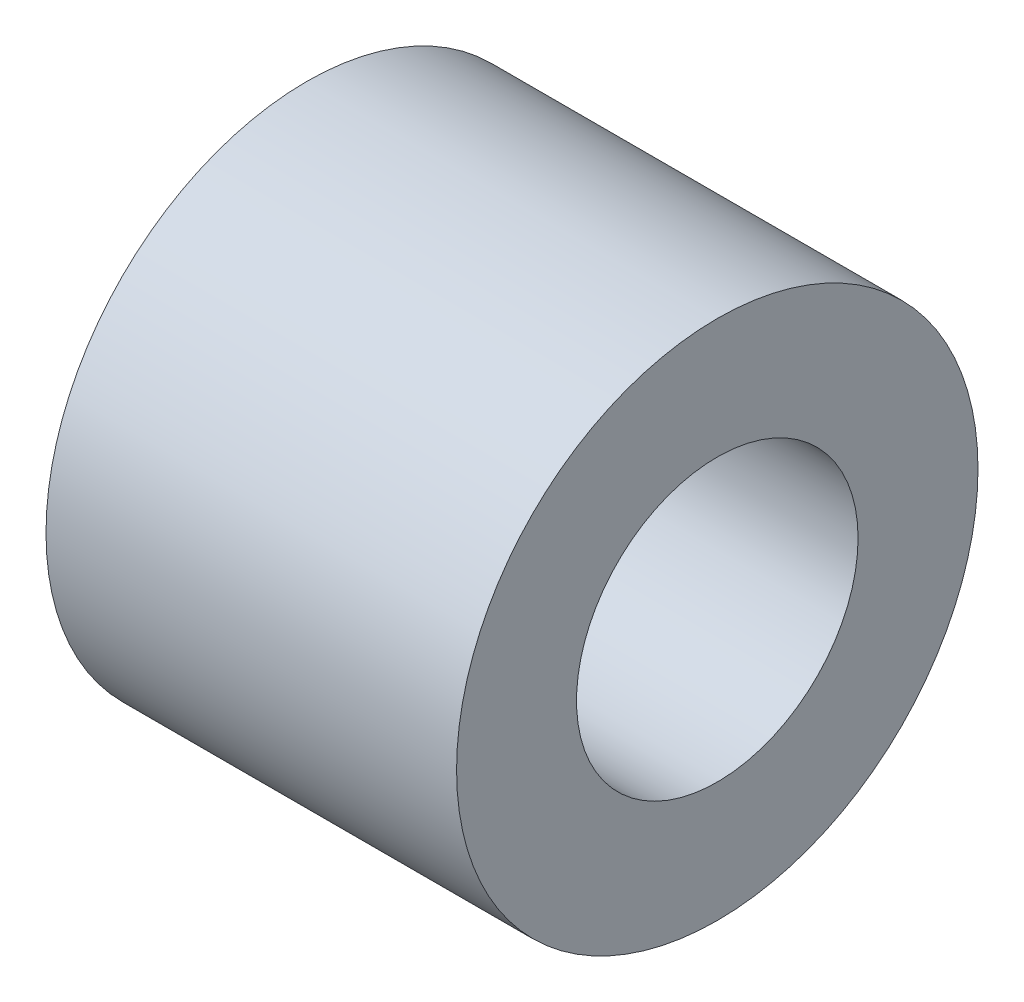
ISO-10303-21;
HEADER;
FILE_DESCRIPTION(('STEP AP214'),'2;1');
FILE_NAME('part.step','',(''),(''),'','','');
FILE_SCHEMA(('AUTOMOTIVE_DESIGN { 1 0 10303 214 1 1 1 1 }'));
ENDSEC;
DATA;
#1=APPLICATION_CONTEXT('core data for automotive mechanical design processes');
#2=APPLICATION_PROTOCOL_DEFINITION('international standard','automotive_design',2000,#1);
#3=PRODUCT_CONTEXT('',#1,'mechanical');
#4=PRODUCT('Part','Part','',(#3));
#5=PRODUCT_RELATED_PRODUCT_CATEGORY('part','',(#4));
#6=PRODUCT_DEFINITION_FORMATION('','',#4);
#7=PRODUCT_DEFINITION_CONTEXT('part definition',#1,'design');
#8=PRODUCT_DEFINITION('design','',#6,#7);
#9=PRODUCT_DEFINITION_SHAPE('','',#8);
#10=(LENGTH_UNIT() NAMED_UNIT(*) SI_UNIT(.MILLI.,.METRE.));
#11=(NAMED_UNIT(*) PLANE_ANGLE_UNIT() SI_UNIT($,.RADIAN.));
#12=(NAMED_UNIT(*) SI_UNIT($,.STERADIAN.) SOLID_ANGLE_UNIT());
#13=UNCERTAINTY_MEASURE_WITH_UNIT(LENGTH_MEASURE(1.E-05),#10,'distance_accuracy_value','');
#14=(GEOMETRIC_REPRESENTATION_CONTEXT(3) GLOBAL_UNCERTAINTY_ASSIGNED_CONTEXT((#13)) GLOBAL_UNIT_ASSIGNED_CONTEXT((#10,
#11,#12)) REPRESENTATION_CONTEXT('',''));
#15=CARTESIAN_POINT('',(0.,0.,0.));
#16=DIRECTION('',(0.,0.,1.));
#17=DIRECTION('',(1.,0.,0.));
#18=AXIS2_PLACEMENT_3D('',#15,#16,#17);
#19=CARTESIAN_POINT('',(-10.,0.,0.));
#20=DIRECTION('',(1.,0.,0.));
#21=DIRECTION('',(0.,0.,-1.));
#22=AXIS2_PLACEMENT_3D('',#19,#20,#21);
#23=CYLINDRICAL_SURFACE('',#22,6.35);
#24=CARTESIAN_POINT('',(-10.,0.,0.));
#25=DIRECTION('',(1.,0.,0.));
#26=DIRECTION('',(0.,0.,-1.));
#27=AXIS2_PLACEMENT_3D('',#24,#25,#26);
#28=CIRCLE('',#27,6.35);
#29=CARTESIAN_POINT('',(-10.,0.,-6.35));
#30=VERTEX_POINT('',#29);
#31=EDGE_CURVE('E10',#30,#30,#28,.T.);
#32=ORIENTED_EDGE('',*,*,#31,.T.);
#33=EDGE_LOOP('',(#32));
#34=FACE_BOUND('',#33,.T.);
#35=CARTESIAN_POINT('',(0.,0.,0.));
#36=DIRECTION('',(1.,0.,0.));
#37=DIRECTION('',(0.,0.,-1.));
#38=AXIS2_PLACEMENT_3D('',#35,#36,#37);
#39=CIRCLE('',#38,6.35);
#40=CARTESIAN_POINT('',(0.,0.,-6.35));
#41=VERTEX_POINT('',#40);
#42=EDGE_CURVE('E34',#41,#41,#39,.T.);
#43=ORIENTED_EDGE('',*,*,#42,.F.);
#44=EDGE_LOOP('',(#43));
#45=FACE_BOUND('',#44,.T.);
#46=ADVANCED_FACE('F31',(#34,#45),#23,.T.);
#47=CARTESIAN_POINT('',(-10.,0.,0.));
#48=DIRECTION('',(1.,0.,0.));
#49=DIRECTION('',(0.,0.,-1.));
#50=AXIS2_PLACEMENT_3D('',#47,#48,#49);
#51=PLANE('',#50);
#52=CARTESIAN_POINT('',(-10.,0.,0.));
#53=DIRECTION('',(1.,0.,0.));
#54=DIRECTION('',(0.,0.,-1.));
#55=AXIS2_PLACEMENT_3D('',#52,#53,#54);
#56=CIRCLE('',#55,3.429);
#57=CARTESIAN_POINT('',(-10.,0.,-3.429));
#58=VERTEX_POINT('',#57);
#59=EDGE_CURVE('E41',#58,#58,#56,.T.);
#60=ORIENTED_EDGE('',*,*,#59,.T.);
#61=EDGE_LOOP('',(#60));
#62=FACE_BOUND('',#61,.T.);
#63=ORIENTED_EDGE('',*,*,#31,.F.);
#64=EDGE_LOOP('',(#63));
#65=FACE_BOUND('',#64,.T.);
#66=ADVANCED_FACE('F49',(#62,#65),#51,.F.);
#67=CARTESIAN_POINT('',(0.,0.,0.));
#68=DIRECTION('',(1.,0.,0.));
#69=DIRECTION('',(0.,0.,-1.));
#70=AXIS2_PLACEMENT_3D('',#67,#68,#69);
#71=PLANE('',#70);
#72=CARTESIAN_POINT('',(0.,0.,0.));
#73=DIRECTION('',(1.,0.,0.));
#74=DIRECTION('',(0.,0.,-1.));
#75=AXIS2_PLACEMENT_3D('',#72,#73,#74);
#76=CIRCLE('',#75,3.429);
#77=CARTESIAN_POINT('',(0.,0.,-3.429));
#78=VERTEX_POINT('',#77);
#79=EDGE_CURVE('E43',#78,#78,#76,.T.);
#80=ORIENTED_EDGE('',*,*,#79,.F.);
#81=EDGE_LOOP('',(#80));
#82=FACE_BOUND('',#81,.T.);
#83=ORIENTED_EDGE('',*,*,#42,.T.);
#84=EDGE_LOOP('',(#83));
#85=FACE_BOUND('',#84,.T.);
#86=ADVANCED_FACE('F55',(#82,#85),#71,.T.);
#87=CARTESIAN_POINT('',(-10.,0.,0.));
#88=DIRECTION('',(1.,0.,0.));
#89=DIRECTION('',(0.,0.,-1.));
#90=AXIS2_PLACEMENT_3D('',#87,#88,#89);
#91=CYLINDRICAL_SURFACE('',#90,3.429);
#92=ORIENTED_EDGE('',*,*,#59,.F.);
#93=EDGE_LOOP('',(#92));
#94=FACE_BOUND('',#93,.T.);
#95=ORIENTED_EDGE('',*,*,#79,.T.);
#96=EDGE_LOOP('',(#95));
#97=FACE_BOUND('',#96,.T.);
#98=ADVANCED_FACE('F52',(#94,#97),#91,.F.);
#99=CLOSED_SHELL('',(#46,#66,#86,#98));
#100=MANIFOLD_SOLID_BREP('B2',#99);
#101=ADVANCED_BREP_SHAPE_REPRESENTATION('',(#18,#100),#14);
#102=SHAPE_DEFINITION_REPRESENTATION(#9,#101);
ENDSEC;
END-ISO-10303-21;
